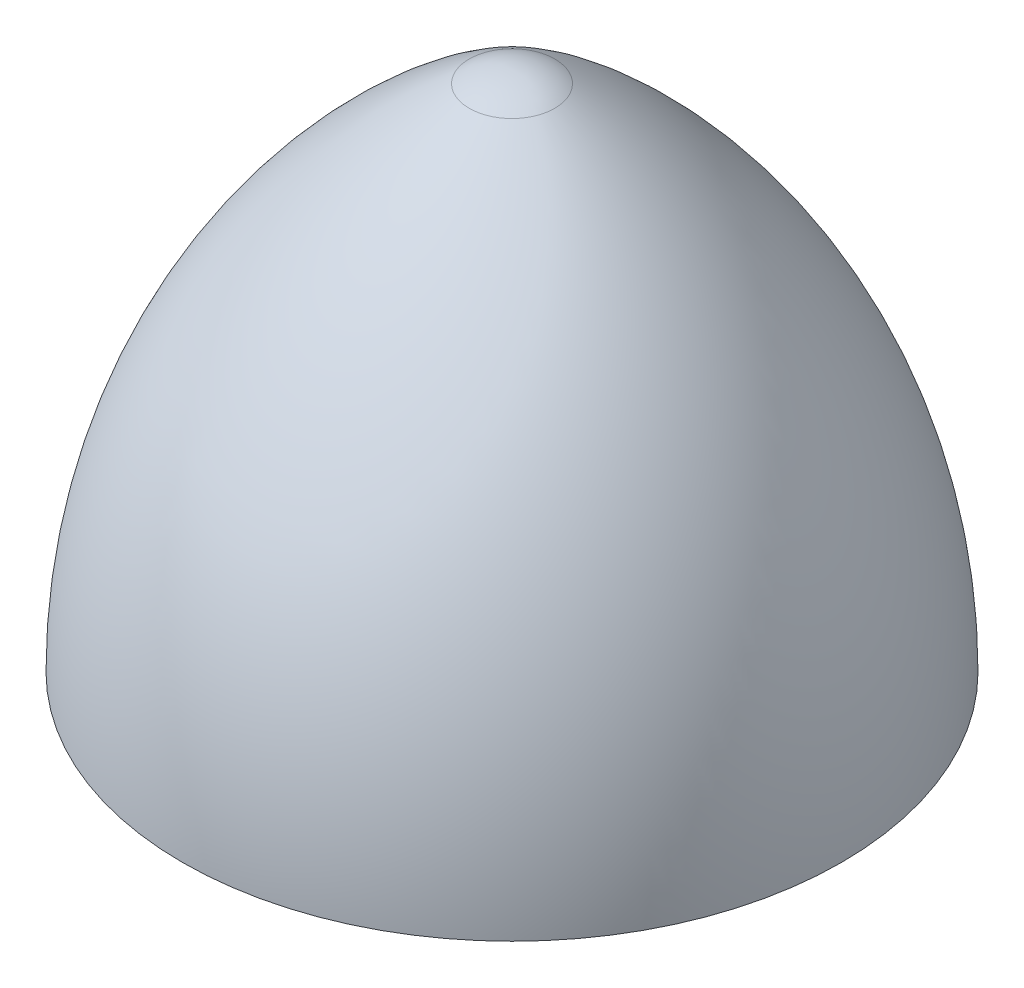
ISO-10303-21;
HEADER;
FILE_DESCRIPTION(('STEP AP214'),'2;1');
FILE_NAME('part.step','',(''),(''),'','','');
FILE_SCHEMA(('AUTOMOTIVE_DESIGN { 1 0 10303 214 1 1 1 1 }'));
ENDSEC;
DATA;
#1=APPLICATION_CONTEXT('core data for automotive mechanical design processes');
#2=APPLICATION_PROTOCOL_DEFINITION('international standard','automotive_design',2000,#1);
#3=PRODUCT_CONTEXT('',#1,'mechanical');
#4=PRODUCT('Part','Part','',(#3));
#5=PRODUCT_RELATED_PRODUCT_CATEGORY('part','',(#4));
#6=PRODUCT_DEFINITION_FORMATION('','',#4);
#7=PRODUCT_DEFINITION_CONTEXT('part definition',#1,'design');
#8=PRODUCT_DEFINITION('design','',#6,#7);
#9=PRODUCT_DEFINITION_SHAPE('','',#8);
#10=(LENGTH_UNIT() NAMED_UNIT(*) SI_UNIT(.MILLI.,.METRE.));
#11=(NAMED_UNIT(*) PLANE_ANGLE_UNIT() SI_UNIT($,.RADIAN.));
#12=(NAMED_UNIT(*) SI_UNIT($,.STERADIAN.) SOLID_ANGLE_UNIT());
#13=UNCERTAINTY_MEASURE_WITH_UNIT(LENGTH_MEASURE(1.E-05),#10,'distance_accuracy_value','');
#14=(GEOMETRIC_REPRESENTATION_CONTEXT(3) GLOBAL_UNCERTAINTY_ASSIGNED_CONTEXT((#13)) GLOBAL_UNIT_ASSIGNED_CONTEXT((#10,
#11,#12)) REPRESENTATION_CONTEXT('',''));
#15=CARTESIAN_POINT('',(0.,0.,0.));
#16=DIRECTION('',(0.,0.,1.));
#17=DIRECTION('',(1.,0.,0.));
#18=AXIS2_PLACEMENT_3D('',#15,#16,#17);
#19=CARTESIAN_POINT('',(0.,-25.4,0.));
#20=DIRECTION('',(0.,-1.,0.));
#21=DIRECTION('',(1.,0.,0.));
#22=AXIS2_PLACEMENT_3D('',#19,#20,#21);
#23=DEGENERATE_TOROIDAL_SURFACE('',#22,15.4340277777778,34.4840277777778,.F.);
#24=CARTESIAN_POINT('',(0.,4.07002967359048,0.));
#25=DIRECTION('',(0.,-1.,0.));
#26=DIRECTION('',(1.,0.,0.));
#27=AXIS2_PLACEMENT_3D('',#24,#25,#26);
#28=CIRCLE('',#27,2.47310830860532);
#29=CARTESIAN_POINT('',(2.47310830860533,4.07002967359048,0.));
#30=VERTEX_POINT('',#29);
#31=EDGE_CURVE('E11',#30,#30,#28,.T.);
#32=ORIENTED_EDGE('',*,*,#31,.T.);
#33=EDGE_LOOP('',(#32));
#34=FACE_BOUND('',#33,.T.);
#35=CARTESIAN_POINT('',(0.,-25.4,0.));
#36=DIRECTION('',(0.,-1.,0.));
#37=DIRECTION('',(1.,0.,0.));
#38=AXIS2_PLACEMENT_3D('',#35,#36,#37);
#39=CIRCLE('',#38,19.05);
#40=CARTESIAN_POINT('',(19.05,-25.4,0.));
#41=VERTEX_POINT('',#40);
#42=EDGE_CURVE('E50',#41,#41,#39,.T.);
#43=ORIENTED_EDGE('',*,*,#42,.F.);
#44=EDGE_LOOP('',(#43));
#45=FACE_BOUND('',#44,.T.);
#46=ADVANCED_FACE('F44',(#34,#45),#23,.F.);
#47=CARTESIAN_POINT('',(0.,0.,0.));
#48=DIRECTION('',(0.,-1.,0.));
#49=DIRECTION('',(1.,0.,0.));
#50=AXIS2_PLACEMENT_3D('',#47,#48,#49);
#51=SPHERICAL_SURFACE('',#50,4.76249999999997);
#52=ORIENTED_EDGE('',*,*,#31,.F.);
#53=EDGE_LOOP('',(#52));
#54=FACE_BOUND('',#53,.T.);
#55=ADVANCED_FACE('F73',(#54),#51,.T.);
#56=CARTESIAN_POINT('',(0.,-25.4,0.));
#57=DIRECTION('',(0.,-1.,0.));
#58=DIRECTION('',(1.,0.,0.));
#59=AXIS2_PLACEMENT_3D('',#56,#57,#58);
#60=PLANE('',#59);
#61=CARTESIAN_POINT('',(0.,-25.4,0.));
#62=DIRECTION('',(0.,-1.,0.));
#63=DIRECTION('',(0.,0.,-1.));
#64=AXIS2_PLACEMENT_3D('',#61,#62,#63);
#65=CIRCLE('',#64,5.75436999999999);
#66=CARTESIAN_POINT('',(0.,-25.4,-5.75436999999999));
#67=VERTEX_POINT('',#66);
#68=EDGE_CURVE('E63',#67,#67,#65,.T.);
#69=ORIENTED_EDGE('',*,*,#68,.F.);
#70=EDGE_LOOP('',(#69));
#71=FACE_BOUND('',#70,.T.);
#72=ORIENTED_EDGE('',*,*,#42,.T.);
#73=EDGE_LOOP('',(#72));
#74=FACE_BOUND('',#73,.T.);
#75=ADVANCED_FACE('F57',(#71,#74),#60,.T.);
#76=CARTESIAN_POINT('',(0.,-8.89,0.));
#77=DIRECTION('',(0.,-1.,0.));
#78=DIRECTION('',(0.,0.,-1.));
#79=AXIS2_PLACEMENT_3D('',#76,#77,#78);
#80=CONICAL_SURFACE('',#79,5.75437,1.02974425867665);
#81=CARTESIAN_POINT('',(0.,-5.43242567968638,0.));
#82=VERTEX_POINT('',#81);
#83=VERTEX_LOOP('',#82);
#84=FACE_BOUND('',#83,.T.);
#85=CARTESIAN_POINT('',(0.,-8.89,0.));
#86=DIRECTION('',(0.,-1.,0.));
#87=DIRECTION('',(0.,0.,-1.));
#88=AXIS2_PLACEMENT_3D('',#85,#86,#87);
#89=CIRCLE('',#88,5.75437);
#90=CARTESIAN_POINT('',(0.,-8.89,-5.75437));
#91=VERTEX_POINT('',#90);
#92=EDGE_CURVE('E61',#91,#91,#89,.T.);
#93=ORIENTED_EDGE('',*,*,#92,.T.);
#94=EDGE_LOOP('',(#93));
#95=FACE_BOUND('',#94,.T.);
#96=ADVANCED_FACE('F53',(#84,#95),#80,.F.);
#97=CARTESIAN_POINT('',(0.,-25.4,0.));
#98=DIRECTION('',(0.,-1.,0.));
#99=DIRECTION('',(0.,0.,-1.));
#100=AXIS2_PLACEMENT_3D('',#97,#98,#99);
#101=CYLINDRICAL_SURFACE('',#100,5.75436999999999);
#102=ORIENTED_EDGE('',*,*,#92,.F.);
#103=EDGE_LOOP('',(#102));
#104=FACE_BOUND('',#103,.T.);
#105=ORIENTED_EDGE('',*,*,#68,.T.);
#106=EDGE_LOOP('',(#105));
#107=FACE_BOUND('',#106,.T.);
#108=ADVANCED_FACE('F56',(#104,#107),#101,.F.);
#109=CLOSED_SHELL('',(#46,#55,#75,#96,#108));
#110=MANIFOLD_SOLID_BREP('B2',#109);
#111=ADVANCED_BREP_SHAPE_REPRESENTATION('',(#18,#110),#14);
#112=SHAPE_DEFINITION_REPRESENTATION(#9,#111);
ENDSEC;
END-ISO-10303-21;
